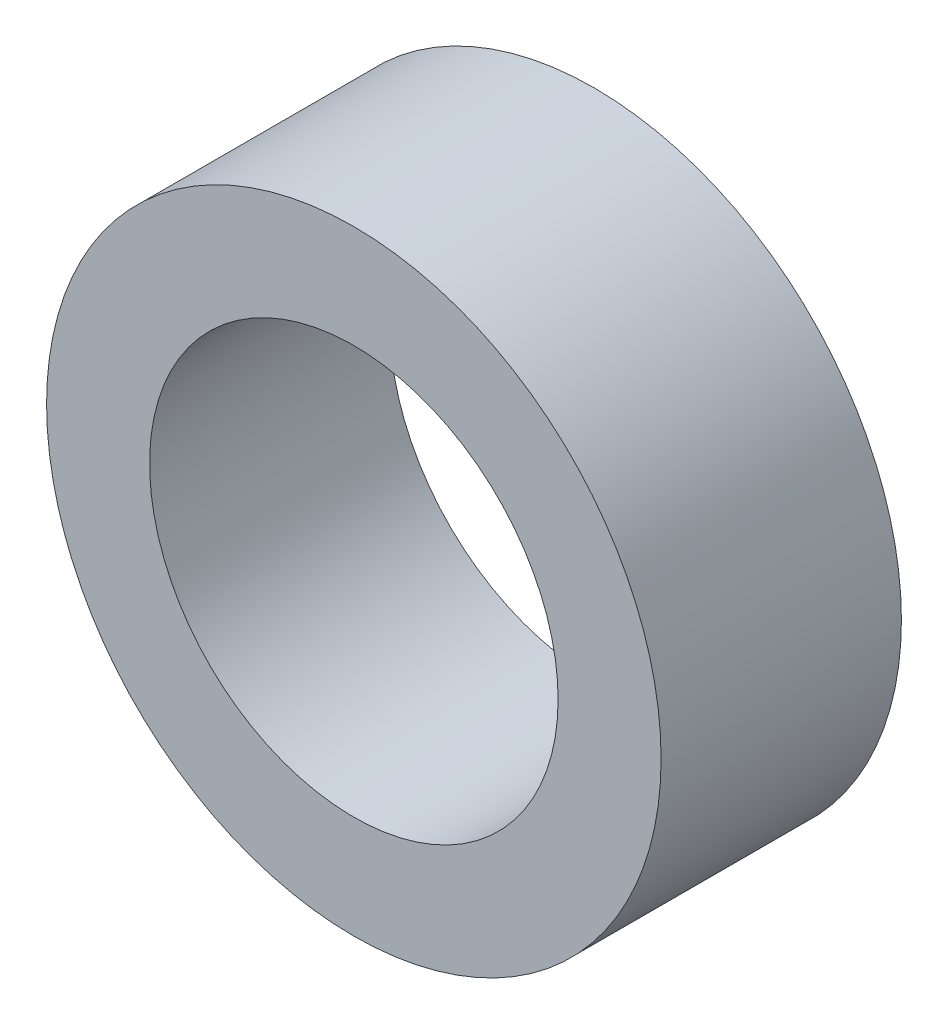
ISO-10303-21;
HEADER;
FILE_DESCRIPTION(('STEP AP214'),'2;1');
FILE_NAME('part.step','',(''),(''),'','','');
FILE_SCHEMA(('AUTOMOTIVE_DESIGN { 1 0 10303 214 1 1 1 1 }'));
ENDSEC;
DATA;
#1=APPLICATION_CONTEXT('core data for automotive mechanical design processes');
#2=APPLICATION_PROTOCOL_DEFINITION('international standard','automotive_design',2000,#1);
#3=PRODUCT_CONTEXT('',#1,'mechanical');
#4=PRODUCT('Part','Part','',(#3));
#5=PRODUCT_RELATED_PRODUCT_CATEGORY('part','',(#4));
#6=PRODUCT_DEFINITION_FORMATION('','',#4);
#7=PRODUCT_DEFINITION_CONTEXT('part definition',#1,'design');
#8=PRODUCT_DEFINITION('design','',#6,#7);
#9=PRODUCT_DEFINITION_SHAPE('','',#8);
#10=(LENGTH_UNIT() NAMED_UNIT(*) SI_UNIT(.MILLI.,.METRE.));
#11=(NAMED_UNIT(*) PLANE_ANGLE_UNIT() SI_UNIT($,.RADIAN.));
#12=(NAMED_UNIT(*) SI_UNIT($,.STERADIAN.) SOLID_ANGLE_UNIT());
#13=UNCERTAINTY_MEASURE_WITH_UNIT(LENGTH_MEASURE(1.E-05),#10,'distance_accuracy_value','');
#14=(GEOMETRIC_REPRESENTATION_CONTEXT(3) GLOBAL_UNCERTAINTY_ASSIGNED_CONTEXT((#13)) GLOBAL_UNIT_ASSIGNED_CONTEXT((#10,
#11,#12)) REPRESENTATION_CONTEXT('',''));
#15=CARTESIAN_POINT('',(0.,0.,0.));
#16=DIRECTION('',(0.,0.,1.));
#17=DIRECTION('',(1.,0.,0.));
#18=AXIS2_PLACEMENT_3D('',#15,#16,#17);
#19=CARTESIAN_POINT('',(0.,0.,-7.));
#20=DIRECTION('',(0.,0.,-1.));
#21=DIRECTION('',(1.,0.,0.));
#22=AXIS2_PLACEMENT_3D('',#19,#20,#21);
#23=PLANE('',#22);
#24=CARTESIAN_POINT('',(0.,0.,-7.));
#25=DIRECTION('',(0.,0.,1.));
#26=DIRECTION('',(1.,0.,0.));
#27=AXIS2_PLACEMENT_3D('',#24,#25,#26);
#28=CIRCLE('',#27,8.95);
#29=CARTESIAN_POINT('',(8.95,0.,-7.));
#30=VERTEX_POINT('',#29);
#31=EDGE_CURVE('E10',#30,#30,#28,.T.);
#32=ORIENTED_EDGE('',*,*,#31,.F.);
#33=EDGE_LOOP('',(#32));
#34=FACE_BOUND('',#33,.T.);
#35=CARTESIAN_POINT('',(0.,0.,-7.));
#36=DIRECTION('',(0.,0.,1.));
#37=DIRECTION('',(1.,0.,0.));
#38=AXIS2_PLACEMENT_3D('',#35,#36,#37);
#39=CIRCLE('',#38,5.95);
#40=CARTESIAN_POINT('',(5.95,0.,-7.));
#41=VERTEX_POINT('',#40);
#42=EDGE_CURVE('E46',#41,#41,#39,.T.);
#43=ORIENTED_EDGE('',*,*,#42,.T.);
#44=EDGE_LOOP('',(#43));
#45=FACE_BOUND('',#44,.T.);
#46=ADVANCED_FACE('F35',(#34,#45),#23,.T.);
#47=CARTESIAN_POINT('',(0.,0.,0.));
#48=DIRECTION('',(0.,0.,-1.));
#49=DIRECTION('',(1.,0.,0.));
#50=AXIS2_PLACEMENT_3D('',#47,#48,#49);
#51=PLANE('',#50);
#52=CARTESIAN_POINT('',(0.,0.,0.));
#53=DIRECTION('',(0.,0.,1.));
#54=DIRECTION('',(1.,0.,0.));
#55=AXIS2_PLACEMENT_3D('',#52,#53,#54);
#56=CIRCLE('',#55,8.95);
#57=CARTESIAN_POINT('',(8.95,0.,0.));
#58=VERTEX_POINT('',#57);
#59=EDGE_CURVE('E39',#58,#58,#56,.T.);
#60=ORIENTED_EDGE('',*,*,#59,.T.);
#61=EDGE_LOOP('',(#60));
#62=FACE_BOUND('',#61,.T.);
#63=CARTESIAN_POINT('',(0.,0.,0.));
#64=DIRECTION('',(0.,0.,1.));
#65=DIRECTION('',(1.,0.,0.));
#66=AXIS2_PLACEMENT_3D('',#63,#64,#65);
#67=CIRCLE('',#66,5.95);
#68=CARTESIAN_POINT('',(5.95,0.,0.));
#69=VERTEX_POINT('',#68);
#70=EDGE_CURVE('E48',#69,#69,#67,.T.);
#71=ORIENTED_EDGE('',*,*,#70,.F.);
#72=EDGE_LOOP('',(#71));
#73=FACE_BOUND('',#72,.T.);
#74=ADVANCED_FACE('F61',(#62,#73),#51,.F.);
#75=CARTESIAN_POINT('',(0.,0.,-7.));
#76=DIRECTION('',(0.,0.,1.));
#77=DIRECTION('',(-1.,0.,0.));
#78=AXIS2_PLACEMENT_3D('',#75,#76,#77);
#79=CYLINDRICAL_SURFACE('',#78,8.95);
#80=ORIENTED_EDGE('',*,*,#31,.T.);
#81=EDGE_LOOP('',(#80));
#82=FACE_BOUND('',#81,.T.);
#83=ORIENTED_EDGE('',*,*,#59,.F.);
#84=EDGE_LOOP('',(#83));
#85=FACE_BOUND('',#84,.T.);
#86=ADVANCED_FACE('F37',(#82,#85),#79,.T.);
#87=CARTESIAN_POINT('',(0.,0.,-7.));
#88=DIRECTION('',(0.,0.,1.));
#89=DIRECTION('',(-1.,0.,0.));
#90=AXIS2_PLACEMENT_3D('',#87,#88,#89);
#91=CYLINDRICAL_SURFACE('',#90,5.95);
#92=ORIENTED_EDGE('',*,*,#42,.F.);
#93=EDGE_LOOP('',(#92));
#94=FACE_BOUND('',#93,.T.);
#95=ORIENTED_EDGE('',*,*,#70,.T.);
#96=EDGE_LOOP('',(#95));
#97=FACE_BOUND('',#96,.T.);
#98=ADVANCED_FACE('F55',(#94,#97),#91,.F.);
#99=CLOSED_SHELL('',(#46,#74,#86,#98));
#100=MANIFOLD_SOLID_BREP('B2',#99);
#101=ADVANCED_BREP_SHAPE_REPRESENTATION('',(#18,#100),#14);
#102=SHAPE_DEFINITION_REPRESENTATION(#9,#101);
ENDSEC;
END-ISO-10303-21;
